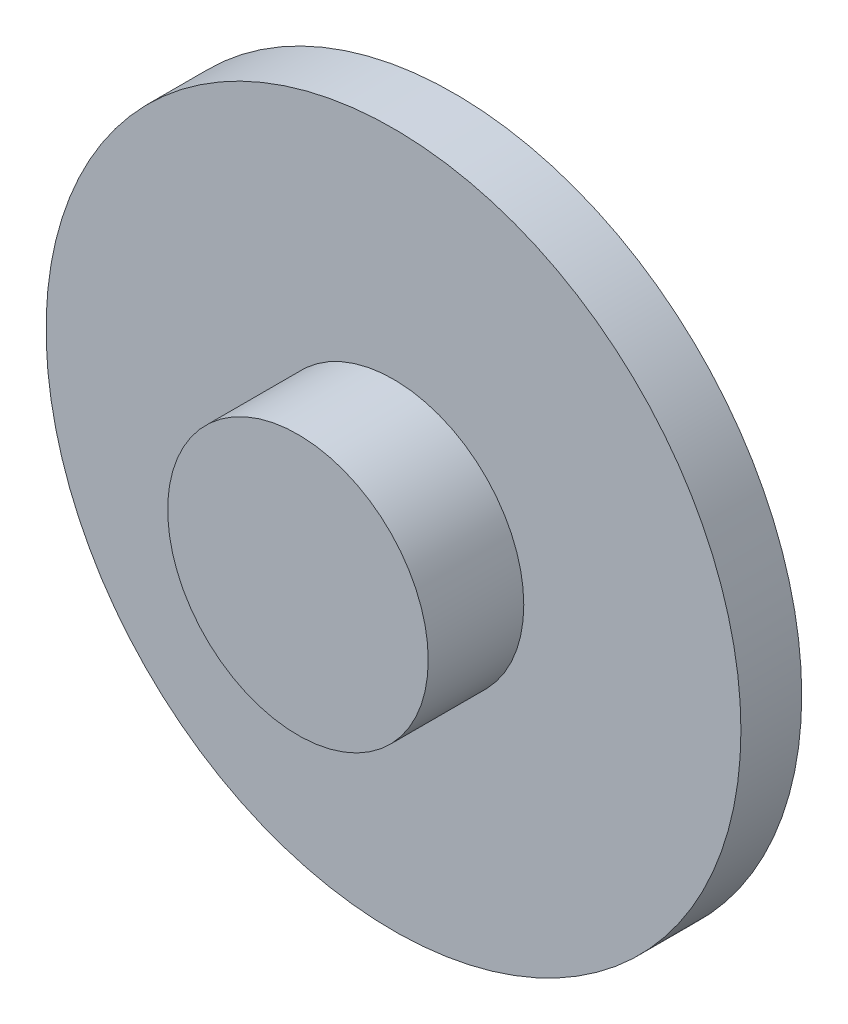
ISO-10303-21;
HEADER;
FILE_DESCRIPTION(('STEP AP214'),'2;1');
FILE_NAME('part.step','',(''),(''),'','','');
FILE_SCHEMA(('AUTOMOTIVE_DESIGN { 1 0 10303 214 1 1 1 1 }'));
ENDSEC;
DATA;
#1=APPLICATION_CONTEXT('core data for automotive mechanical design processes');
#2=APPLICATION_PROTOCOL_DEFINITION('international standard','automotive_design',2000,#1);
#3=PRODUCT_CONTEXT('',#1,'mechanical');
#4=PRODUCT('Part','Part','',(#3));
#5=PRODUCT_RELATED_PRODUCT_CATEGORY('part','',(#4));
#6=PRODUCT_DEFINITION_FORMATION('','',#4);
#7=PRODUCT_DEFINITION_CONTEXT('part definition',#1,'design');
#8=PRODUCT_DEFINITION('design','',#6,#7);
#9=PRODUCT_DEFINITION_SHAPE('','',#8);
#10=(LENGTH_UNIT() NAMED_UNIT(*) SI_UNIT(.MILLI.,.METRE.));
#11=(NAMED_UNIT(*) PLANE_ANGLE_UNIT() SI_UNIT($,.RADIAN.));
#12=(NAMED_UNIT(*) SI_UNIT($,.STERADIAN.) SOLID_ANGLE_UNIT());
#13=UNCERTAINTY_MEASURE_WITH_UNIT(LENGTH_MEASURE(1.E-05),#10,'distance_accuracy_value','');
#14=(GEOMETRIC_REPRESENTATION_CONTEXT(3) GLOBAL_UNCERTAINTY_ASSIGNED_CONTEXT((#13)) GLOBAL_UNIT_ASSIGNED_CONTEXT((#10,
#11,#12)) REPRESENTATION_CONTEXT('',''));
#15=CARTESIAN_POINT('',(0.,0.,0.));
#16=DIRECTION('',(0.,0.,1.));
#17=DIRECTION('',(1.,0.,0.));
#18=AXIS2_PLACEMENT_3D('',#15,#16,#17);
#19=CARTESIAN_POINT('',(0.,0.,1.778));
#20=DIRECTION('',(0.,0.,-1.));
#21=DIRECTION('',(-1.,0.,0.));
#22=AXIS2_PLACEMENT_3D('',#19,#20,#21);
#23=CYLINDRICAL_SURFACE('',#22,10.16);
#24=CARTESIAN_POINT('',(0.,0.,1.778));
#25=DIRECTION('',(0.,0.,1.));
#26=DIRECTION('',(1.,0.,0.));
#27=AXIS2_PLACEMENT_3D('',#24,#25,#26);
#28=CIRCLE('',#27,10.16);
#29=CARTESIAN_POINT('',(10.16,0.,1.778));
#30=VERTEX_POINT('',#29);
#31=EDGE_CURVE('E10',#30,#30,#28,.T.);
#32=ORIENTED_EDGE('',*,*,#31,.F.);
#33=EDGE_LOOP('',(#32));
#34=FACE_BOUND('',#33,.T.);
#35=CARTESIAN_POINT('',(0.,0.,0.));
#36=DIRECTION('',(0.,0.,1.));
#37=DIRECTION('',(1.,0.,0.));
#38=AXIS2_PLACEMENT_3D('',#35,#36,#37);
#39=CIRCLE('',#38,10.16);
#40=CARTESIAN_POINT('',(10.16,0.,0.));
#41=VERTEX_POINT('',#40);
#42=EDGE_CURVE('E42',#41,#41,#39,.T.);
#43=ORIENTED_EDGE('',*,*,#42,.T.);
#44=EDGE_LOOP('',(#43));
#45=FACE_BOUND('',#44,.T.);
#46=ADVANCED_FACE('F39',(#34,#45),#23,.T.);
#47=CARTESIAN_POINT('',(0.,0.,1.778));
#48=DIRECTION('',(0.,0.,1.));
#49=DIRECTION('',(1.,0.,0.));
#50=AXIS2_PLACEMENT_3D('',#47,#48,#49);
#51=PLANE('',#50);
#52=CARTESIAN_POINT('',(0.,0.,1.778));
#53=DIRECTION('',(0.,0.,1.));
#54=DIRECTION('',(1.,0.,0.));
#55=AXIS2_PLACEMENT_3D('',#52,#53,#54);
#56=CIRCLE('',#55,3.81);
#57=CARTESIAN_POINT('',(3.81,0.,1.778));
#58=VERTEX_POINT('',#57);
#59=EDGE_CURVE('E47',#58,#58,#56,.T.);
#60=ORIENTED_EDGE('',*,*,#59,.F.);
#61=EDGE_LOOP('',(#60));
#62=FACE_BOUND('',#61,.T.);
#63=ORIENTED_EDGE('',*,*,#31,.T.);
#64=EDGE_LOOP('',(#63));
#65=FACE_BOUND('',#64,.T.);
#66=ADVANCED_FACE('F67',(#62,#65),#51,.T.);
#67=CARTESIAN_POINT('',(0.,0.,0.));
#68=DIRECTION('',(0.,0.,1.));
#69=DIRECTION('',(1.,0.,0.));
#70=AXIS2_PLACEMENT_3D('',#67,#68,#69);
#71=PLANE('',#70);
#72=ORIENTED_EDGE('',*,*,#42,.F.);
#73=EDGE_LOOP('',(#72));
#74=FACE_BOUND('',#73,.T.);
#75=ADVANCED_FACE('F64',(#74),#71,.F.);
#76=CARTESIAN_POINT('',(0.,0.,4.572));
#77=DIRECTION('',(0.,0.,-1.));
#78=DIRECTION('',(-1.,0.,0.));
#79=AXIS2_PLACEMENT_3D('',#76,#77,#78);
#80=CYLINDRICAL_SURFACE('',#79,3.81);
#81=ORIENTED_EDGE('',*,*,#59,.T.);
#82=EDGE_LOOP('',(#81));
#83=FACE_BOUND('',#82,.T.);
#84=CARTESIAN_POINT('',(0.,0.,4.572));
#85=DIRECTION('',(0.,0.,1.));
#86=DIRECTION('',(1.,0.,0.));
#87=AXIS2_PLACEMENT_3D('',#84,#85,#86);
#88=CIRCLE('',#87,3.81);
#89=CARTESIAN_POINT('',(3.81,0.,4.572));
#90=VERTEX_POINT('',#89);
#91=EDGE_CURVE('E54',#90,#90,#88,.T.);
#92=ORIENTED_EDGE('',*,*,#91,.F.);
#93=EDGE_LOOP('',(#92));
#94=FACE_BOUND('',#93,.T.);
#95=ADVANCED_FACE('F66',(#83,#94),#80,.T.);
#96=CARTESIAN_POINT('',(0.,0.,4.572));
#97=DIRECTION('',(0.,0.,1.));
#98=DIRECTION('',(1.,0.,0.));
#99=AXIS2_PLACEMENT_3D('',#96,#97,#98);
#100=PLANE('',#99);
#101=ORIENTED_EDGE('',*,*,#91,.T.);
#102=EDGE_LOOP('',(#101));
#103=FACE_BOUND('',#102,.T.);
#104=ADVANCED_FACE('F72',(#103),#100,.T.);
#105=CLOSED_SHELL('',(#46,#66,#75,#95,#104));
#106=MANIFOLD_SOLID_BREP('B2',#105);
#107=ADVANCED_BREP_SHAPE_REPRESENTATION('',(#18,#106),#14);
#108=SHAPE_DEFINITION_REPRESENTATION(#9,#107);
ENDSEC;
END-ISO-10303-21;
